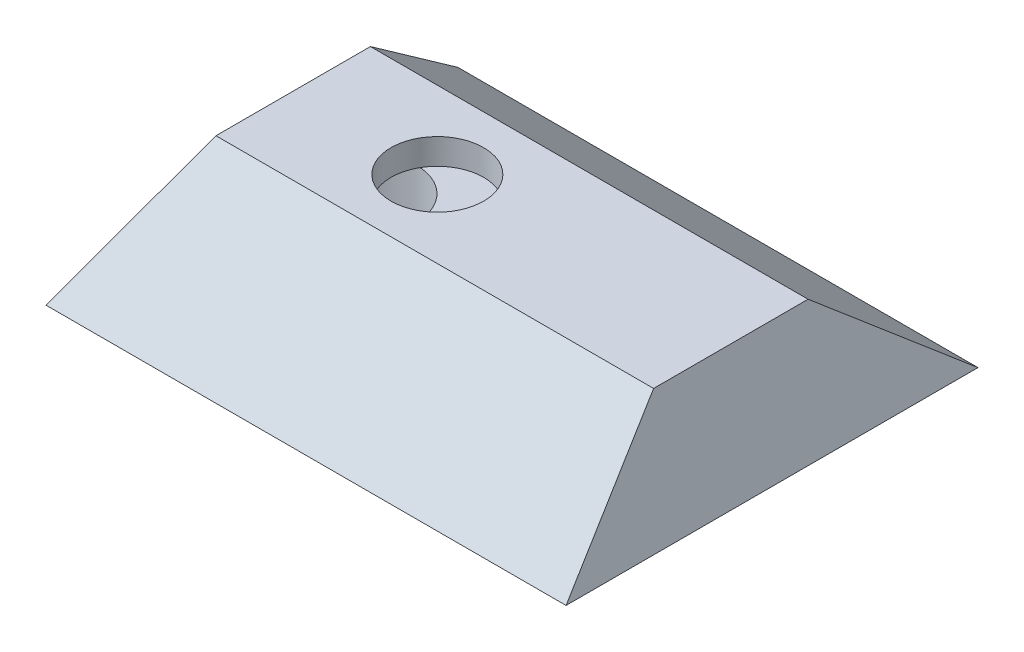
ISO-10303-21;
HEADER;
FILE_DESCRIPTION(('STEP AP214'),'2;1');
FILE_NAME('part.step','',(''),(''),'','','');
FILE_SCHEMA(('AUTOMOTIVE_DESIGN { 1 0 10303 214 1 1 1 1 }'));
ENDSEC;
DATA;
#1=APPLICATION_CONTEXT('core data for automotive mechanical design processes');
#2=APPLICATION_PROTOCOL_DEFINITION('international standard','automotive_design',2000,#1);
#3=PRODUCT_CONTEXT('',#1,'mechanical');
#4=PRODUCT('Part','Part','',(#3));
#5=PRODUCT_RELATED_PRODUCT_CATEGORY('part','',(#4));
#6=PRODUCT_DEFINITION_FORMATION('','',#4);
#7=PRODUCT_DEFINITION_CONTEXT('part definition',#1,'design');
#8=PRODUCT_DEFINITION('design','',#6,#7);
#9=PRODUCT_DEFINITION_SHAPE('','',#8);
#10=(LENGTH_UNIT() NAMED_UNIT(*) SI_UNIT(.MILLI.,.METRE.));
#11=(NAMED_UNIT(*) PLANE_ANGLE_UNIT() SI_UNIT($,.RADIAN.));
#12=(NAMED_UNIT(*) SI_UNIT($,.STERADIAN.) SOLID_ANGLE_UNIT());
#13=UNCERTAINTY_MEASURE_WITH_UNIT(LENGTH_MEASURE(1.E-05),#10,'distance_accuracy_value','');
#14=(GEOMETRIC_REPRESENTATION_CONTEXT(3) GLOBAL_UNCERTAINTY_ASSIGNED_CONTEXT((#13)) GLOBAL_UNIT_ASSIGNED_CONTEXT((#10,
#11,#12)) REPRESENTATION_CONTEXT('',''));
#15=CARTESIAN_POINT('',(0.,0.,0.));
#16=DIRECTION('',(0.,0.,1.));
#17=DIRECTION('',(1.,0.,0.));
#18=AXIS2_PLACEMENT_3D('',#15,#16,#17);
#19=CARTESIAN_POINT('',(-14.5,0.,0.));
#20=DIRECTION('',(0.,1.,0.));
#21=DIRECTION('',(0.,0.,1.));
#22=AXIS2_PLACEMENT_3D('',#19,#20,#21);
#23=CYLINDRICAL_SURFACE('',#22,3.5);
#24=CARTESIAN_POINT('',(-14.5,-6.,0.));
#25=DIRECTION('',(0.,-1.,0.));
#26=DIRECTION('',(0.,0.,-1.));
#27=AXIS2_PLACEMENT_3D('',#24,#25,#26);
#28=CIRCLE('',#27,3.5);
#29=CARTESIAN_POINT('',(-14.5,-6.,-3.5));
#30=VERTEX_POINT('',#29);
#31=EDGE_CURVE('E280',#30,#30,#28,.F.);
#32=ORIENTED_EDGE('',*,*,#31,.F.);
#33=EDGE_LOOP('',(#32));
#34=FACE_BOUND('',#33,.T.);
#35=CARTESIAN_POINT('',(-14.5,3.,0.));
#36=DIRECTION('',(0.,1.,0.));
#37=DIRECTION('',(0.,0.,1.));
#38=AXIS2_PLACEMENT_3D('',#35,#36,#37);
#39=CIRCLE('',#38,3.5);
#40=CARTESIAN_POINT('',(-14.5,3.,3.5));
#41=VERTEX_POINT('',#40);
#42=EDGE_CURVE('E267',#41,#41,#39,.F.);
#43=ORIENTED_EDGE('',*,*,#42,.F.);
#44=EDGE_LOOP('',(#43));
#45=FACE_BOUND('',#44,.T.);
#46=ADVANCED_FACE('F46',(#34,#45),#23,.F.);
#47=CARTESIAN_POINT('',(0.,7.,0.));
#48=DIRECTION('',(0.,-1.,0.));
#49=DIRECTION('',(0.,0.,-1.));
#50=AXIS2_PLACEMENT_3D('',#47,#48,#49);
#51=PLANE('',#50);
#52=CARTESIAN_POINT('',(-35.,7.,-7.));
#53=DIRECTION('',(0.,-1.,0.));
#54=DIRECTION('',(0.,0.,-1.));
#55=AXIS2_PLACEMENT_3D('',#52,#53,#54);
#56=CIRCLE('',#55,9.5);
#57=CARTESIAN_POINT('',(-40.,7.,1.07774721070176));
#58=VERTEX_POINT('',#57);
#59=CARTESIAN_POINT('',(-40.,7.,-15.0777472107018));
#60=VERTEX_POINT('',#59);
#61=EDGE_CURVE('E294',#58,#60,#56,.T.);
#62=ORIENTED_EDGE('',*,*,#61,.T.);
#63=DIRECTION('',(0.,0.,1.));
#64=VECTOR('',#63,1.);
#65=CARTESIAN_POINT('',(-40.,7.,0.));
#66=LINE('',#65,#64);
#67=EDGE_CURVE('E68',#60,#58,#66,.T.);
#68=ORIENTED_EDGE('',*,*,#67,.T.);
#69=EDGE_LOOP('',(#62,#68));
#70=FACE_BOUND('',#69,.T.);
#71=ADVANCED_FACE('F403',(#70),#51,.T.);
#72=CARTESIAN_POINT('',(-35.,7.,-7.));
#73=DIRECTION('',(0.,-1.,0.));
#74=DIRECTION('',(0.,0.,-1.));
#75=AXIS2_PLACEMENT_3D('',#72,#73,#74);
#76=CYLINDRICAL_SURFACE('',#75,9.5);
#77=CARTESIAN_POINT('',(-35.,-19.,-7.));
#78=DIRECTION('',(0.,-1.,0.));
#79=DIRECTION('',(0.,0.,-1.));
#80=AXIS2_PLACEMENT_3D('',#77,#78,#79);
#81=CIRCLE('',#80,9.5);
#82=CARTESIAN_POINT('',(-35.,-19.,-16.5));
#83=VERTEX_POINT('',#82);
#84=EDGE_CURVE('E273',#83,#83,#81,.T.);
#85=ORIENTED_EDGE('',*,*,#84,.T.);
#86=EDGE_LOOP('',(#85));
#87=FACE_BOUND('',#86,.T.);
#88=DIRECTION('',(0.,-1.,0.));
#89=VECTOR('',#88,1.);
#90=CARTESIAN_POINT('',(-40.,7.,1.07774721070176));
#91=LINE('',#90,#89);
#92=CARTESIAN_POINT('',(-40.,3.,1.07774721070176));
#93=VERTEX_POINT('',#92);
#94=EDGE_CURVE('E13',#93,#58,#91,.F.);
#95=ORIENTED_EDGE('',*,*,#94,.F.);
#96=CARTESIAN_POINT('',(-35.,3.,-7.));
#97=DIRECTION('',(0.,1.,0.));
#98=DIRECTION('',(0.,0.,1.));
#99=AXIS2_PLACEMENT_3D('',#96,#97,#98);
#100=CIRCLE('',#99,9.5);
#101=CARTESIAN_POINT('',(-40.,3.,-15.0777472107018));
#102=VERTEX_POINT('',#101);
#103=EDGE_CURVE('E54',#102,#93,#100,.F.);
#104=ORIENTED_EDGE('',*,*,#103,.F.);
#105=DIRECTION('',(0.,-1.,0.));
#106=VECTOR('',#105,1.);
#107=CARTESIAN_POINT('',(-40.,7.,-15.0777472107018));
#108=LINE('',#107,#106);
#109=EDGE_CURVE('E388',#60,#102,#108,.T.);
#110=ORIENTED_EDGE('',*,*,#109,.F.);
#111=ORIENTED_EDGE('',*,*,#61,.F.);
#112=EDGE_LOOP('',(#95,#104,#110,#111));
#113=FACE_BOUND('',#112,.T.);
#114=ADVANCED_FACE('F401',(#87,#113),#76,.F.);
#115=CARTESIAN_POINT('',(0.,-6.,0.));
#116=DIRECTION('',(0.,-1.,0.));
#117=DIRECTION('',(0.,0.,-1.));
#118=AXIS2_PLACEMENT_3D('',#115,#116,#117);
#119=PLANE('',#118);
#120=DIRECTION('',(-0.991377719329722,0.,0.131035177019758));
#121=VECTOR('',#120,1.);
#122=CARTESIAN_POINT('',(0.258679788565059,-6.,1.95710331116396));
#123=LINE('',#122,#121);
#124=CARTESIAN_POINT('',(-9.5,-6.,3.24695510896138));
#125=VERTEX_POINT('',#124);
#126=CARTESIAN_POINT('',(-33.2310251102333,-6.,6.38359921095124));
#127=VERTEX_POINT('',#126);
#128=EDGE_CURVE('E285',#125,#127,#123,.T.);
#129=ORIENTED_EDGE('',*,*,#128,.T.);
#130=CARTESIAN_POINT('',(-35.,-6.,-7.));
#131=DIRECTION('',(0.,-1.,0.));
#132=DIRECTION('',(0.,0.,-1.));
#133=AXIS2_PLACEMENT_3D('',#130,#131,#132);
#134=CIRCLE('',#133,13.5);
#135=CARTESIAN_POINT('',(-32.1926854124584,-6.,-20.2048848842607));
#136=VERTEX_POINT('',#135);
#137=EDGE_CURVE('E287',#127,#136,#134,.T.);
#138=ORIENTED_EDGE('',*,*,#137,.T.);
#139=DIRECTION('',(-0.978139621056347,0.,-0.207949228706783));
#140=VECTOR('',#139,1.);
#141=CARTESIAN_POINT('',(2.71763738571395,-6.,-12.783066420405));
#142=LINE('',#141,#140);
#143=CARTESIAN_POINT('',(-9.5,-6.,-15.3804954747915));
#144=VERTEX_POINT('',#143);
#145=EDGE_CURVE('E289',#144,#136,#142,.T.);
#146=ORIENTED_EDGE('',*,*,#145,.F.);
#147=DIRECTION('',(0.,0.,1.));
#148=VECTOR('',#147,1.);
#149=CARTESIAN_POINT('',(-9.5,-6.,0.));
#150=LINE('',#149,#148);
#151=EDGE_CURVE('E292',#144,#125,#150,.T.);
#152=ORIENTED_EDGE('',*,*,#151,.T.);
#153=EDGE_LOOP('',(#129,#138,#146,#152));
#154=FACE_BOUND('',#153,.T.);
#155=ORIENTED_EDGE('',*,*,#31,.T.);
#156=EDGE_LOOP('',(#155));
#157=FACE_BOUND('',#156,.T.);
#158=CARTESIAN_POINT('',(-35.,-6.,-7.));
#159=DIRECTION('',(0.,-1.,0.));
#160=DIRECTION('',(0.,0.,-1.));
#161=AXIS2_PLACEMENT_3D('',#158,#159,#160);
#162=CIRCLE('',#161,10.);
#163=CARTESIAN_POINT('',(-35.,-6.,-17.));
#164=VERTEX_POINT('',#163);
#165=EDGE_CURVE('E276',#164,#164,#162,.T.);
#166=ORIENTED_EDGE('',*,*,#165,.F.);
#167=EDGE_LOOP('',(#166));
#168=FACE_BOUND('',#167,.T.);
#169=ADVANCED_FACE('F410',(#154,#157,#168),#119,.T.);
#170=CARTESIAN_POINT('',(0.,20.,0.));
#171=DIRECTION('',(0.,1.,0.));
#172=DIRECTION('',(0.,0.,1.));
#173=AXIS2_PLACEMENT_3D('',#170,#171,#172);
#174=PLANE('',#173);
#175=CARTESIAN_POINT('',(-14.5,20.,0.));
#176=DIRECTION('',(0.,1.,0.));
#177=DIRECTION('',(0.,0.,1.));
#178=AXIS2_PLACEMENT_3D('',#175,#176,#177);
#179=CIRCLE('',#178,9.);
#180=CARTESIAN_POINT('',(-14.5,20.,9.));
#181=VERTEX_POINT('',#180);
#182=EDGE_CURVE('E344',#181,#181,#179,.T.);
#183=ORIENTED_EDGE('',*,*,#182,.F.);
#184=EDGE_LOOP('',(#183));
#185=FACE_BOUND('',#184,.T.);
#186=DIRECTION('',(0.,0.,-1.));
#187=VECTOR('',#186,1.);
#188=CARTESIAN_POINT('',(42.5,20.,-15.));
#189=LINE('',#188,#187);
#190=CARTESIAN_POINT('',(42.5,20.,15.));
#191=VERTEX_POINT('',#190);
#192=CARTESIAN_POINT('',(42.5,20.,-15.));
#193=VERTEX_POINT('',#192);
#194=EDGE_CURVE('E380',#191,#193,#189,.T.);
#195=ORIENTED_EDGE('',*,*,#194,.T.);
#196=DIRECTION('',(-1.,0.,0.));
#197=VECTOR('',#196,1.);
#198=CARTESIAN_POINT('',(-42.5,20.,-15.));
#199=LINE('',#198,#197);
#200=CARTESIAN_POINT('',(-42.5,20.,-15.));
#201=VERTEX_POINT('',#200);
#202=EDGE_CURVE('E382',#193,#201,#199,.T.);
#203=ORIENTED_EDGE('',*,*,#202,.T.);
#204=DIRECTION('',(0.,0.,1.));
#205=VECTOR('',#204,1.);
#206=CARTESIAN_POINT('',(-42.5,20.,-15.));
#207=LINE('',#206,#205);
#208=CARTESIAN_POINT('',(-42.5,20.,15.));
#209=VERTEX_POINT('',#208);
#210=EDGE_CURVE('E384',#201,#209,#207,.T.);
#211=ORIENTED_EDGE('',*,*,#210,.T.);
#212=DIRECTION('',(1.,0.,0.));
#213=VECTOR('',#212,1.);
#214=CARTESIAN_POINT('',(-42.5,20.,15.));
#215=LINE('',#214,#213);
#216=EDGE_CURVE('E386',#209,#191,#215,.T.);
#217=ORIENTED_EDGE('',*,*,#216,.T.);
#218=EDGE_LOOP('',(#195,#203,#211,#217));
#219=FACE_BOUND('',#218,.T.);
#220=ADVANCED_FACE('F474',(#185,#219),#174,.T.);
#221=CARTESIAN_POINT('',(0.,0.,0.));
#222=DIRECTION('',(0.,1.,0.));
#223=DIRECTION('',(0.,0.,1.));
#224=AXIS2_PLACEMENT_3D('',#221,#222,#223);
#225=PLANE('',#224);
#226=DIRECTION('',(0.,0.,1.));
#227=VECTOR('',#226,1.);
#228=CARTESIAN_POINT('',(42.9725378665182,0.,-25.6796791291549));
#229=LINE('',#228,#227);
#230=CARTESIAN_POINT('',(42.9725378665182,0.,-25.6796791291549));
#231=VERTEX_POINT('',#230);
#232=CARTESIAN_POINT('',(42.9725378665182,0.,20.8667200088257));
#233=VERTEX_POINT('',#232);
#234=EDGE_CURVE('E226',#231,#233,#229,.T.);
#235=ORIENTED_EDGE('',*,*,#234,.F.);
#236=DIRECTION('',(1.,0.,0.));
#237=VECTOR('',#236,1.);
#238=CARTESIAN_POINT('',(8.35418713721481,0.,-25.6796791291549));
#239=LINE('',#238,#237);
#240=CARTESIAN_POINT('',(8.35418713721481,0.,-25.6796791291549));
#241=VERTEX_POINT('',#240);
#242=EDGE_CURVE('E61',#241,#231,#239,.T.);
#243=ORIENTED_EDGE('',*,*,#242,.F.);
#244=DIRECTION('',(0.,0.,-1.));
#245=VECTOR('',#244,1.);
#246=CARTESIAN_POINT('',(8.35418713721481,0.,-25.6796791291549));
#247=LINE('',#246,#245);
#248=CARTESIAN_POINT('',(8.35418713721481,0.,20.8667200088257));
#249=VERTEX_POINT('',#248);
#250=EDGE_CURVE('E217',#249,#241,#247,.T.);
#251=ORIENTED_EDGE('',*,*,#250,.F.);
#252=DIRECTION('',(-1.,0.,0.));
#253=VECTOR('',#252,1.);
#254=CARTESIAN_POINT('',(8.35418713721481,0.,20.8667200088257));
#255=LINE('',#254,#253);
#256=EDGE_CURVE('E220',#233,#249,#255,.T.);
#257=ORIENTED_EDGE('',*,*,#256,.F.);
#258=EDGE_LOOP('',(#235,#243,#251,#257));
#259=FACE_BOUND('',#258,.T.);
#260=DIRECTION('',(-0.991377719329722,0.,0.131035177019758));
#261=VECTOR('',#260,1.);
#262=CARTESIAN_POINT('',(0.520750142604575,0.,3.9398587498234));
#263=LINE('',#262,#261);
#264=CARTESIAN_POINT('',(-7.5,0.,5.));
#265=VERTEX_POINT('',#264);
#266=CARTESIAN_POINT('',(-32.9689547561938,0.,8.36635464961069));
#267=VERTEX_POINT('',#266);
#268=EDGE_CURVE('E297',#265,#267,#263,.T.);
#269=ORIENTED_EDGE('',*,*,#268,.F.);
#270=DIRECTION('',(0.,0.,1.));
#271=VECTOR('',#270,1.);
#272=CARTESIAN_POINT('',(-7.5,0.,0.));
#273=LINE('',#272,#271);
#274=CARTESIAN_POINT('',(-7.5,0.,-17.));
#275=VERTEX_POINT('',#274);
#276=EDGE_CURVE('E302',#275,#265,#273,.T.);
#277=ORIENTED_EDGE('',*,*,#276,.F.);
#278=DIRECTION('',(-0.978139621056347,0.,-0.207949228706783));
#279=VECTOR('',#278,1.);
#280=CARTESIAN_POINT('',(3.13353584312752,0.,-14.7393456625177));
#281=LINE('',#280,#279);
#282=CARTESIAN_POINT('',(-31.7767869550449,0.,-22.1611641263734));
#283=VERTEX_POINT('',#282);
#284=EDGE_CURVE('E326',#275,#283,#281,.T.);
#285=ORIENTED_EDGE('',*,*,#284,.T.);
#286=CARTESIAN_POINT('',(-35.,0.,-7.));
#287=DIRECTION('',(0.,-1.,0.));
#288=DIRECTION('',(0.,0.,-1.));
#289=AXIS2_PLACEMENT_3D('',#286,#287,#288);
#290=CIRCLE('',#289,15.5);
#291=CARTESIAN_POINT('',(-50.5,0.,-7.));
#292=VERTEX_POINT('',#291);
#293=EDGE_CURVE('E327',#292,#283,#290,.T.);
#294=ORIENTED_EDGE('',*,*,#293,.F.);
#295=DIRECTION('',(0.,0.,1.));
#296=VECTOR('',#295,1.);
#297=CARTESIAN_POINT('',(-50.5,0.,-55.5112692638357));
#298=LINE('',#297,#296);
#299=CARTESIAN_POINT('',(-50.5,0.,-40.));
#300=VERTEX_POINT('',#299);
#301=EDGE_CURVE('E364',#300,#292,#298,.T.);
#302=ORIENTED_EDGE('',*,*,#301,.F.);
#303=DIRECTION('',(1.,0.,0.));
#304=VECTOR('',#303,1.);
#305=CARTESIAN_POINT('',(-74.5156211871643,0.,-40.));
#306=LINE('',#305,#304);
#307=CARTESIAN_POINT('',(50.5,0.,-40.));
#308=VERTEX_POINT('',#307);
#309=EDGE_CURVE('E378',#300,#308,#306,.T.);
#310=ORIENTED_EDGE('',*,*,#309,.T.);
#311=DIRECTION('',(0.,0.,1.));
#312=VECTOR('',#311,1.);
#313=CARTESIAN_POINT('',(50.5,0.,-55.5112692638357));
#314=LINE('',#313,#312);
#315=CARTESIAN_POINT('',(50.5,0.,40.));
#316=VERTEX_POINT('',#315);
#317=EDGE_CURVE('E370',#308,#316,#314,.T.);
#318=ORIENTED_EDGE('',*,*,#317,.T.);
#319=DIRECTION('',(1.,0.,0.));
#320=VECTOR('',#319,1.);
#321=CARTESIAN_POINT('',(-74.5156211871643,0.,40.));
#322=LINE('',#321,#320);
#323=CARTESIAN_POINT('',(-50.5,0.,40.));
#324=VERTEX_POINT('',#323);
#325=EDGE_CURVE('E374',#324,#316,#322,.T.);
#326=ORIENTED_EDGE('',*,*,#325,.F.);
#327=EDGE_CURVE('E363',#292,#324,#298,.T.);
#328=ORIENTED_EDGE('',*,*,#327,.F.);
#329=EDGE_CURVE('E323',#267,#292,#290,.T.);
#330=ORIENTED_EDGE('',*,*,#329,.F.);
#331=EDGE_LOOP('',(#269,#277,#285,#294,#302,#310,#318,#326,#328,#330));
#332=FACE_BOUND('',#331,.T.);
#333=ADVANCED_FACE('F48',(#259,#332),#225,.F.);
#334=CARTESIAN_POINT('',(-74.5156211871643,20.,-15.));
#335=DIRECTION('',(0.,0.78086880944303,-0.624695047554424));
#336=DIRECTION('',(0.,0.624695047554424,0.78086880944303));
#337=AXIS2_PLACEMENT_3D('',#334,#335,#336);
#338=PLANE('',#337);
#339=ORIENTED_EDGE('',*,*,#309,.F.);
#340=DIRECTION('',(-0.242424242424242,-0.606060606060606,-0.757575757575758));
#341=VECTOR('',#340,1.);
#342=CARTESIAN_POINT('',(-49.9400861825226,1.39978454369343,-38.2502693203832));
#343=LINE('',#342,#341);
#344=EDGE_CURVE('E360',#201,#300,#343,.T.);
#345=ORIENTED_EDGE('',*,*,#344,.F.);
#346=ORIENTED_EDGE('',*,*,#202,.F.);
#347=DIRECTION('',(-0.242424242424243,0.606060606060606,0.757575757575758));
#348=VECTOR('',#347,1.);
#349=CARTESIAN_POINT('',(49.9400861825226,1.39978454369345,-38.2502693203832));
#350=LINE('',#349,#348);
#351=EDGE_CURVE('E371',#308,#193,#350,.T.);
#352=ORIENTED_EDGE('',*,*,#351,.F.);
#353=EDGE_LOOP('',(#339,#345,#346,#352));
#354=FACE_BOUND('',#353,.T.);
#355=ADVANCED_FACE('F470',(#354),#338,.T.);
#356=CARTESIAN_POINT('',(-74.5156211871643,20.,15.));
#357=DIRECTION('',(0.,0.78086880944303,0.624695047554424));
#358=DIRECTION('',(0.,-0.624695047554424,0.78086880944303));
#359=AXIS2_PLACEMENT_3D('',#356,#357,#358);
#360=PLANE('',#359);
#361=ORIENTED_EDGE('',*,*,#216,.F.);
#362=DIRECTION('',(-0.242424242424242,-0.606060606060606,0.757575757575758));
#363=VECTOR('',#362,1.);
#364=CARTESIAN_POINT('',(-49.9400861825226,1.39978454369343,38.2502693203832));
#365=LINE('',#364,#363);
#366=EDGE_CURVE('E357',#209,#324,#365,.T.);
#367=ORIENTED_EDGE('',*,*,#366,.T.);
#368=ORIENTED_EDGE('',*,*,#325,.T.);
#369=DIRECTION('',(-0.242424242424243,0.606060606060606,-0.757575757575758));
#370=VECTOR('',#369,1.);
#371=CARTESIAN_POINT('',(49.9400861825226,1.39978454369344,38.2502693203832));
#372=LINE('',#371,#370);
#373=EDGE_CURVE('E367',#316,#191,#372,.T.);
#374=ORIENTED_EDGE('',*,*,#373,.T.);
#375=EDGE_LOOP('',(#361,#367,#368,#374));
#376=FACE_BOUND('',#375,.T.);
#377=ADVANCED_FACE('F466',(#376),#360,.T.);
#378=CARTESIAN_POINT('',(42.5,20.,-55.5112692638357));
#379=DIRECTION('',(0.928476690885259,0.371390676354104,0.));
#380=DIRECTION('',(-0.371390676354104,0.928476690885259,0.));
#381=AXIS2_PLACEMENT_3D('',#378,#379,#380);
#382=PLANE('',#381);
#383=ORIENTED_EDGE('',*,*,#317,.F.);
#384=ORIENTED_EDGE('',*,*,#351,.T.);
#385=ORIENTED_EDGE('',*,*,#194,.F.);
#386=ORIENTED_EDGE('',*,*,#373,.F.);
#387=EDGE_LOOP('',(#383,#384,#385,#386));
#388=FACE_BOUND('',#387,.T.);
#389=ADVANCED_FACE('F462',(#388),#382,.T.);
#390=CARTESIAN_POINT('',(-42.5,20.,-55.5112692638357));
#391=DIRECTION('',(-0.92847669088526,0.371390676354103,0.));
#392=DIRECTION('',(-0.371390676354103,-0.92847669088526,0.));
#393=AXIS2_PLACEMENT_3D('',#390,#391,#392);
#394=PLANE('',#393);
#395=ORIENTED_EDGE('',*,*,#210,.F.);
#396=ORIENTED_EDGE('',*,*,#344,.T.);
#397=ORIENTED_EDGE('',*,*,#301,.T.);
#398=ORIENTED_EDGE('',*,*,#327,.T.);
#399=ORIENTED_EDGE('',*,*,#366,.F.);
#400=EDGE_LOOP('',(#395,#396,#397,#398,#399));
#401=FACE_BOUND('',#400,.T.);
#402=ADVANCED_FACE('F457',(#401),#394,.T.);
#403=CARTESIAN_POINT('',(-14.5,15.,0.));
#404=DIRECTION('',(0.,1.,0.));
#405=DIRECTION('',(0.,0.,1.));
#406=AXIS2_PLACEMENT_3D('',#403,#404,#405);
#407=CYLINDRICAL_SURFACE('',#406,9.);
#408=CARTESIAN_POINT('',(-14.5,15.,0.));
#409=DIRECTION('',(0.,-1.,0.));
#410=DIRECTION('',(0.,0.,-1.));
#411=AXIS2_PLACEMENT_3D('',#408,#409,#410);
#412=CIRCLE('',#411,9.);
#413=CARTESIAN_POINT('',(-14.5,15.,-9.));
#414=VERTEX_POINT('',#413);
#415=EDGE_CURVE('E270',#414,#414,#412,.F.);
#416=ORIENTED_EDGE('',*,*,#415,.F.);
#417=EDGE_LOOP('',(#416));
#418=FACE_BOUND('',#417,.T.);
#419=ORIENTED_EDGE('',*,*,#182,.T.);
#420=EDGE_LOOP('',(#419));
#421=FACE_BOUND('',#420,.T.);
#422=ADVANCED_FACE('F440',(#418,#421),#407,.F.);
#423=CARTESIAN_POINT('',(0.520750142604575,-9.,3.9398587498234));
#424=DIRECTION('',(-0.131035177019758,0.,-0.991377719329722));
#425=DIRECTION('',(-0.991377719329722,0.,0.131035177019758));
#426=AXIS2_PLACEMENT_3D('',#423,#424,#425);
#427=PLANE('',#426);
#428=ORIENTED_EDGE('',*,*,#268,.T.);
#429=DIRECTION('',(0.,1.,0.));
#430=VECTOR('',#429,1.);
#431=CARTESIAN_POINT('',(-32.9689547561938,-9.,8.36635464961069));
#432=LINE('',#431,#430);
#433=CARTESIAN_POINT('',(-32.9689547561938,-9.,8.36635464961069));
#434=VERTEX_POINT('',#433);
#435=EDGE_CURVE('E341',#434,#267,#432,.T.);
#436=ORIENTED_EDGE('',*,*,#435,.F.);
#437=DIRECTION('',(-0.991377719329722,0.,0.131035177019758));
#438=VECTOR('',#437,1.);
#439=CARTESIAN_POINT('',(0.520750142604575,-9.,3.9398587498234));
#440=LINE('',#439,#438);
#441=CARTESIAN_POINT('',(-7.5,-9.,5.));
#442=VERTEX_POINT('',#441);
#443=EDGE_CURVE('E310',#442,#434,#440,.T.);
#444=ORIENTED_EDGE('',*,*,#443,.F.);
#445=DIRECTION('',(0.,1.,0.));
#446=VECTOR('',#445,1.);
#447=CARTESIAN_POINT('',(-7.5,-9.,5.));
#448=LINE('',#447,#446);
#449=EDGE_CURVE('E331',#442,#265,#448,.T.);
#450=ORIENTED_EDGE('',*,*,#449,.T.);
#451=EDGE_LOOP('',(#428,#436,#444,#450));
#452=FACE_BOUND('',#451,.T.);
#453=ADVANCED_FACE('F436',(#452),#427,.F.);
#454=CARTESIAN_POINT('',(-35.,-9.,-7.));
#455=DIRECTION('',(0.,1.,0.));
#456=DIRECTION('',(0.,0.,1.));
#457=AXIS2_PLACEMENT_3D('',#454,#455,#456);
#458=CYLINDRICAL_SURFACE('',#457,15.5);
#459=ORIENTED_EDGE('',*,*,#329,.T.);
#460=ORIENTED_EDGE('',*,*,#293,.T.);
#461=DIRECTION('',(0.,1.,0.));
#462=VECTOR('',#461,1.);
#463=CARTESIAN_POINT('',(-31.7767869550449,-9.,-22.1611641263734));
#464=LINE('',#463,#462);
#465=CARTESIAN_POINT('',(-31.7767869550449,-9.,-22.1611641263734));
#466=VERTEX_POINT('',#465);
#467=EDGE_CURVE('E338',#466,#283,#464,.T.);
#468=ORIENTED_EDGE('',*,*,#467,.F.);
#469=CARTESIAN_POINT('',(-35.,-9.,-7.));
#470=DIRECTION('',(0.,-1.,0.));
#471=DIRECTION('',(0.,0.,-1.));
#472=AXIS2_PLACEMENT_3D('',#469,#470,#471);
#473=CIRCLE('',#472,15.5);
#474=EDGE_CURVE('E313',#434,#466,#473,.T.);
#475=ORIENTED_EDGE('',*,*,#474,.F.);
#476=ORIENTED_EDGE('',*,*,#435,.T.);
#477=EDGE_LOOP('',(#459,#460,#468,#475,#476));
#478=FACE_BOUND('',#477,.T.);
#479=ADVANCED_FACE('F432',(#478),#458,.T.);
#480=CARTESIAN_POINT('',(3.13353584312752,-9.,-14.7393456625177));
#481=DIRECTION('',(0.207949228706783,0.,-0.978139621056347));
#482=DIRECTION('',(-0.978139621056347,0.,-0.207949228706783));
#483=AXIS2_PLACEMENT_3D('',#480,#481,#482);
#484=PLANE('',#483);
#485=ORIENTED_EDGE('',*,*,#284,.F.);
#486=DIRECTION('',(0.,1.,0.));
#487=VECTOR('',#486,1.);
#488=CARTESIAN_POINT('',(-7.5,-9.,-17.));
#489=LINE('',#488,#487);
#490=CARTESIAN_POINT('',(-7.5,-9.,-17.));
#491=VERTEX_POINT('',#490);
#492=EDGE_CURVE('E334',#491,#275,#489,.T.);
#493=ORIENTED_EDGE('',*,*,#492,.F.);
#494=DIRECTION('',(-0.978139621056347,0.,-0.207949228706783));
#495=VECTOR('',#494,1.);
#496=CARTESIAN_POINT('',(3.13353584312752,-9.,-14.7393456625177));
#497=LINE('',#496,#495);
#498=EDGE_CURVE('E315',#491,#466,#497,.T.);
#499=ORIENTED_EDGE('',*,*,#498,.T.);
#500=ORIENTED_EDGE('',*,*,#467,.T.);
#501=EDGE_LOOP('',(#485,#493,#499,#500));
#502=FACE_BOUND('',#501,.T.);
#503=ADVANCED_FACE('F428',(#502),#484,.T.);
#504=CARTESIAN_POINT('',(-35.,-9.,-7.));
#505=DIRECTION('',(0.,1.,0.));
#506=DIRECTION('',(0.,0.,1.));
#507=AXIS2_PLACEMENT_3D('',#504,#505,#506);
#508=CYLINDRICAL_SURFACE('',#507,13.5);
#509=ORIENTED_EDGE('',*,*,#137,.F.);
#510=DIRECTION('',(0.,1.,0.));
#511=VECTOR('',#510,1.);
#512=CARTESIAN_POINT('',(-33.2310251102333,-9.,6.38359921095124));
#513=LINE('',#512,#511);
#514=CARTESIAN_POINT('',(-33.2310251102333,-9.,6.38359921095124));
#515=VERTEX_POINT('',#514);
#516=EDGE_CURVE('E335',#515,#127,#513,.T.);
#517=ORIENTED_EDGE('',*,*,#516,.F.);
#518=CARTESIAN_POINT('',(-35.,-9.,-7.));
#519=DIRECTION('',(0.,-1.,0.));
#520=DIRECTION('',(0.,0.,-1.));
#521=AXIS2_PLACEMENT_3D('',#518,#519,#520);
#522=CIRCLE('',#521,13.5);
#523=CARTESIAN_POINT('',(-32.1926854124584,-9.,-20.2048848842607));
#524=VERTEX_POINT('',#523);
#525=EDGE_CURVE('E298',#515,#524,#522,.T.);
#526=ORIENTED_EDGE('',*,*,#525,.T.);
#527=DIRECTION('',(0.,1.,0.));
#528=VECTOR('',#527,1.);
#529=CARTESIAN_POINT('',(-32.1926854124584,-9.,-20.2048848842607));
#530=LINE('',#529,#528);
#531=EDGE_CURVE('E320',#524,#136,#530,.T.);
#532=ORIENTED_EDGE('',*,*,#531,.T.);
#533=EDGE_LOOP('',(#509,#517,#526,#532));
#534=FACE_BOUND('',#533,.T.);
#535=ADVANCED_FACE('F431',(#534),#508,.F.);
#536=CARTESIAN_POINT('',(0.258679788565059,-9.,1.95710331116396));
#537=DIRECTION('',(-0.131035177019758,0.,-0.991377719329722));
#538=DIRECTION('',(-0.991377719329722,0.,0.131035177019758));
#539=AXIS2_PLACEMENT_3D('',#536,#537,#538);
#540=PLANE('',#539);
#541=ORIENTED_EDGE('',*,*,#128,.F.);
#542=DIRECTION('',(0.,1.,0.));
#543=VECTOR('',#542,1.);
#544=CARTESIAN_POINT('',(-9.5,-9.,3.24695510896138));
#545=LINE('',#544,#543);
#546=CARTESIAN_POINT('',(-9.5,-9.,3.24695510896138));
#547=VERTEX_POINT('',#546);
#548=EDGE_CURVE('E350',#547,#125,#545,.T.);
#549=ORIENTED_EDGE('',*,*,#548,.F.);
#550=DIRECTION('',(-0.991377719329722,0.,0.131035177019758));
#551=VECTOR('',#550,1.);
#552=CARTESIAN_POINT('',(0.258679788565059,-9.,1.95710331116396));
#553=LINE('',#552,#551);
#554=EDGE_CURVE('E301',#547,#515,#553,.T.);
#555=ORIENTED_EDGE('',*,*,#554,.T.);
#556=ORIENTED_EDGE('',*,*,#516,.T.);
#557=EDGE_LOOP('',(#541,#549,#555,#556));
#558=FACE_BOUND('',#557,.T.);
#559=ADVANCED_FACE('F448',(#558),#540,.T.);
#560=CARTESIAN_POINT('',(-9.5,-9.,0.));
#561=DIRECTION('',(-1.,0.,0.));
#562=DIRECTION('',(0.,0.,1.));
#563=AXIS2_PLACEMENT_3D('',#560,#561,#562);
#564=PLANE('',#563);
#565=ORIENTED_EDGE('',*,*,#151,.F.);
#566=DIRECTION('',(0.,1.,0.));
#567=VECTOR('',#566,1.);
#568=CARTESIAN_POINT('',(-9.5,-9.,-15.3804954747915));
#569=LINE('',#568,#567);
#570=CARTESIAN_POINT('',(-9.5,-9.,-15.3804954747915));
#571=VERTEX_POINT('',#570);
#572=EDGE_CURVE('E347',#571,#144,#569,.T.);
#573=ORIENTED_EDGE('',*,*,#572,.F.);
#574=DIRECTION('',(0.,0.,1.));
#575=VECTOR('',#574,1.);
#576=CARTESIAN_POINT('',(-9.5,-9.,0.));
#577=LINE('',#576,#575);
#578=EDGE_CURVE('E305',#571,#547,#577,.T.);
#579=ORIENTED_EDGE('',*,*,#578,.T.);
#580=ORIENTED_EDGE('',*,*,#548,.T.);
#581=EDGE_LOOP('',(#565,#573,#579,#580));
#582=FACE_BOUND('',#581,.T.);
#583=ADVANCED_FACE('F444',(#582),#564,.T.);
#584=CARTESIAN_POINT('',(2.71763738571395,-9.,-12.783066420405));
#585=DIRECTION('',(0.207949228706783,0.,-0.978139621056347));
#586=DIRECTION('',(-0.978139621056347,0.,-0.207949228706783));
#587=AXIS2_PLACEMENT_3D('',#584,#585,#586);
#588=PLANE('',#587);
#589=ORIENTED_EDGE('',*,*,#572,.T.);
#590=ORIENTED_EDGE('',*,*,#145,.T.);
#591=ORIENTED_EDGE('',*,*,#531,.F.);
#592=DIRECTION('',(-0.978139621056347,0.,-0.207949228706783));
#593=VECTOR('',#592,1.);
#594=CARTESIAN_POINT('',(2.71763738571395,-9.,-12.783066420405));
#595=LINE('',#594,#593);
#596=EDGE_CURVE('E308',#571,#524,#595,.T.);
#597=ORIENTED_EDGE('',*,*,#596,.F.);
#598=EDGE_LOOP('',(#589,#590,#591,#597));
#599=FACE_BOUND('',#598,.T.);
#600=ADVANCED_FACE('F426',(#599),#588,.F.);
#601=CARTESIAN_POINT('',(-7.5,-9.,0.));
#602=DIRECTION('',(-1.,0.,0.));
#603=DIRECTION('',(0.,0.,1.));
#604=AXIS2_PLACEMENT_3D('',#601,#602,#603);
#605=PLANE('',#604);
#606=ORIENTED_EDGE('',*,*,#276,.T.);
#607=ORIENTED_EDGE('',*,*,#449,.F.);
#608=DIRECTION('',(0.,0.,1.));
#609=VECTOR('',#608,1.);
#610=CARTESIAN_POINT('',(-7.5,-9.,0.));
#611=LINE('',#610,#609);
#612=EDGE_CURVE('E318',#491,#442,#611,.T.);
#613=ORIENTED_EDGE('',*,*,#612,.F.);
#614=ORIENTED_EDGE('',*,*,#492,.T.);
#615=EDGE_LOOP('',(#606,#607,#613,#614));
#616=FACE_BOUND('',#615,.T.);
#617=ADVANCED_FACE('F422',(#616),#605,.F.);
#618=CARTESIAN_POINT('',(0.,-9.,0.));
#619=DIRECTION('',(0.,-1.,0.));
#620=DIRECTION('',(0.,0.,-1.));
#621=AXIS2_PLACEMENT_3D('',#618,#619,#620);
#622=PLANE('',#621);
#623=ORIENTED_EDGE('',*,*,#525,.F.);
#624=ORIENTED_EDGE('',*,*,#554,.F.);
#625=ORIENTED_EDGE('',*,*,#578,.F.);
#626=ORIENTED_EDGE('',*,*,#596,.T.);
#627=EDGE_LOOP('',(#623,#624,#625,#626));
#628=FACE_BOUND('',#627,.T.);
#629=ORIENTED_EDGE('',*,*,#443,.T.);
#630=ORIENTED_EDGE('',*,*,#474,.T.);
#631=ORIENTED_EDGE('',*,*,#498,.F.);
#632=ORIENTED_EDGE('',*,*,#612,.T.);
#633=EDGE_LOOP('',(#629,#630,#631,#632));
#634=FACE_BOUND('',#633,.T.);
#635=ADVANCED_FACE('F418',(#628,#634),#622,.T.);
#636=CARTESIAN_POINT('',(-35.,-19.,-7.));
#637=DIRECTION('',(0.,-1.,0.));
#638=DIRECTION('',(0.,0.,-1.));
#639=AXIS2_PLACEMENT_3D('',#636,#637,#638);
#640=PLANE('',#639);
#641=CARTESIAN_POINT('',(-35.,-19.,-7.));
#642=DIRECTION('',(0.,-1.,0.));
#643=DIRECTION('',(0.,0.,-1.));
#644=AXIS2_PLACEMENT_3D('',#641,#642,#643);
#645=CIRCLE('',#644,10.);
#646=CARTESIAN_POINT('',(-35.,-19.,-17.));
#647=VERTEX_POINT('',#646);
#648=EDGE_CURVE('E277',#647,#647,#645,.T.);
#649=ORIENTED_EDGE('',*,*,#648,.T.);
#650=EDGE_LOOP('',(#649));
#651=FACE_BOUND('',#650,.T.);
#652=ORIENTED_EDGE('',*,*,#84,.F.);
#653=EDGE_LOOP('',(#652));
#654=FACE_BOUND('',#653,.T.);
#655=ADVANCED_FACE('F421',(#651,#654),#640,.T.);
#656=CARTESIAN_POINT('',(-35.,-19.,-7.));
#657=DIRECTION('',(0.,1.,0.));
#658=DIRECTION('',(0.,0.,1.));
#659=AXIS2_PLACEMENT_3D('',#656,#657,#658);
#660=CYLINDRICAL_SURFACE('',#659,10.);
#661=ORIENTED_EDGE('',*,*,#648,.F.);
#662=EDGE_LOOP('',(#661));
#663=FACE_BOUND('',#662,.T.);
#664=ORIENTED_EDGE('',*,*,#165,.T.);
#665=EDGE_LOOP('',(#664));
#666=FACE_BOUND('',#665,.T.);
#667=ADVANCED_FACE('F517',(#663,#666),#660,.T.);
#668=CARTESIAN_POINT('',(5.,15.,18.8488284109627));
#669=DIRECTION('',(0.,-1.,0.));
#670=DIRECTION('',(0.,0.,-1.));
#671=AXIS2_PLACEMENT_3D('',#668,#669,#670);
#672=PLANE('',#671);
#673=DIRECTION('',(-1.,0.,0.));
#674=VECTOR('',#673,1.);
#675=CARTESIAN_POINT('',(5.,15.,-18.8488284109627));
#676=LINE('',#675,#674);
#677=CARTESIAN_POINT('',(5.,15.,-18.8488284109627));
#678=VERTEX_POINT('',#677);
#679=CARTESIAN_POINT('',(-40.,15.,-18.8488284109627));
#680=VERTEX_POINT('',#679);
#681=EDGE_CURVE('E259',#678,#680,#676,.T.);
#682=ORIENTED_EDGE('',*,*,#681,.F.);
#683=DIRECTION('',(0.,0.,1.));
#684=VECTOR('',#683,1.);
#685=CARTESIAN_POINT('',(5.,15.,18.8488284109627));
#686=LINE('',#685,#684);
#687=CARTESIAN_POINT('',(5.,15.,18.8488284109627));
#688=VERTEX_POINT('',#687);
#689=EDGE_CURVE('E255',#678,#688,#686,.T.);
#690=ORIENTED_EDGE('',*,*,#689,.T.);
#691=DIRECTION('',(-1.,0.,0.));
#692=VECTOR('',#691,1.);
#693=CARTESIAN_POINT('',(5.,15.,18.8488284109627));
#694=LINE('',#693,#692);
#695=CARTESIAN_POINT('',(-40.,15.,18.8488284109627));
#696=VERTEX_POINT('',#695);
#697=EDGE_CURVE('E257',#688,#696,#694,.T.);
#698=ORIENTED_EDGE('',*,*,#697,.T.);
#699=DIRECTION('',(0.,0.,1.));
#700=VECTOR('',#699,1.);
#701=CARTESIAN_POINT('',(-40.,15.,18.8488284109627));
#702=LINE('',#701,#700);
#703=EDGE_CURVE('E245',#680,#696,#702,.T.);
#704=ORIENTED_EDGE('',*,*,#703,.F.);
#705=EDGE_LOOP('',(#682,#690,#698,#704));
#706=FACE_BOUND('',#705,.T.);
#707=ORIENTED_EDGE('',*,*,#415,.T.);
#708=EDGE_LOOP('',(#707));
#709=FACE_BOUND('',#708,.T.);
#710=ADVANCED_FACE('F519',(#706,#709),#672,.T.);
#711=CARTESIAN_POINT('',(5.,3.,-33.8488284109627));
#712=DIRECTION('',(0.,1.,0.));
#713=DIRECTION('',(0.,0.,1.));
#714=AXIS2_PLACEMENT_3D('',#711,#712,#713);
#715=PLANE('',#714);
#716=ORIENTED_EDGE('',*,*,#103,.T.);
#717=DIRECTION('',(0.,0.,-1.));
#718=VECTOR('',#717,1.);
#719=CARTESIAN_POINT('',(-40.,3.,-33.8488284109627));
#720=LINE('',#719,#718);
#721=CARTESIAN_POINT('',(-40.,3.,33.8488284109627));
#722=VERTEX_POINT('',#721);
#723=EDGE_CURVE('E239',#722,#93,#720,.T.);
#724=ORIENTED_EDGE('',*,*,#723,.F.);
#725=DIRECTION('',(-1.,0.,0.));
#726=VECTOR('',#725,1.);
#727=CARTESIAN_POINT('',(5.,3.,33.8488284109627));
#728=LINE('',#727,#726);
#729=CARTESIAN_POINT('',(5.,3.,33.8488284109627));
#730=VERTEX_POINT('',#729);
#731=EDGE_CURVE('E264',#730,#722,#728,.T.);
#732=ORIENTED_EDGE('',*,*,#731,.F.);
#733=DIRECTION('',(0.,0.,-1.));
#734=VECTOR('',#733,1.);
#735=CARTESIAN_POINT('',(5.,3.,-33.8488284109627));
#736=LINE('',#735,#734);
#737=CARTESIAN_POINT('',(5.,3.,-33.8488284109627));
#738=VERTEX_POINT('',#737);
#739=EDGE_CURVE('E251',#730,#738,#736,.T.);
#740=ORIENTED_EDGE('',*,*,#739,.T.);
#741=DIRECTION('',(-1.,0.,0.));
#742=VECTOR('',#741,1.);
#743=CARTESIAN_POINT('',(5.,3.,-33.8488284109627));
#744=LINE('',#743,#742);
#745=CARTESIAN_POINT('',(-40.,3.,-33.8488284109627));
#746=VERTEX_POINT('',#745);
#747=EDGE_CURVE('E261',#738,#746,#744,.T.);
#748=ORIENTED_EDGE('',*,*,#747,.T.);
#749=EDGE_CURVE('E238',#102,#746,#720,.T.);
#750=ORIENTED_EDGE('',*,*,#749,.F.);
#751=EDGE_LOOP('',(#716,#724,#732,#740,#748,#750));
#752=FACE_BOUND('',#751,.T.);
#753=ORIENTED_EDGE('',*,*,#42,.T.);
#754=EDGE_LOOP('',(#753));
#755=FACE_BOUND('',#754,.T.);
#756=ADVANCED_FACE('F393',(#752,#755),#715,.T.);
#757=CARTESIAN_POINT('',(-40.,0.,0.));
#758=DIRECTION('',(1.,0.,0.));
#759=DIRECTION('',(0.,0.,-1.));
#760=AXIS2_PLACEMENT_3D('',#757,#758,#759);
#761=PLANE('',#760);
#762=ORIENTED_EDGE('',*,*,#94,.T.);
#763=ORIENTED_EDGE('',*,*,#67,.F.);
#764=ORIENTED_EDGE('',*,*,#109,.T.);
#765=ORIENTED_EDGE('',*,*,#749,.T.);
#766=DIRECTION('',(0.,0.624695047554424,0.78086880944303));
#767=VECTOR('',#766,1.);
#768=CARTESIAN_POINT('',(-40.,3.,-33.8488284109627));
#769=LINE('',#768,#767);
#770=EDGE_CURVE('E242',#746,#680,#769,.T.);
#771=ORIENTED_EDGE('',*,*,#770,.T.);
#772=ORIENTED_EDGE('',*,*,#703,.T.);
#773=DIRECTION('',(0.,-0.624695047554424,0.780868809443031));
#774=VECTOR('',#773,1.);
#775=CARTESIAN_POINT('',(-40.,3.,33.8488284109627));
#776=LINE('',#775,#774);
#777=EDGE_CURVE('E232',#696,#722,#776,.T.);
#778=ORIENTED_EDGE('',*,*,#777,.T.);
#779=ORIENTED_EDGE('',*,*,#723,.T.);
#780=EDGE_LOOP('',(#762,#763,#764,#765,#771,#772,#778,#779));
#781=FACE_BOUND('',#780,.T.);
#782=ADVANCED_FACE('F398',(#781),#761,.T.);
#783=CARTESIAN_POINT('',(5.,3.,33.8488284109627));
#784=DIRECTION('',(0.,-0.780868809443031,-0.624695047554424));
#785=DIRECTION('',(0.,0.624695047554424,-0.780868809443031));
#786=AXIS2_PLACEMENT_3D('',#783,#784,#785);
#787=PLANE('',#786);
#788=ORIENTED_EDGE('',*,*,#697,.F.);
#789=DIRECTION('',(0.,-0.624695047554424,0.780868809443031));
#790=VECTOR('',#789,1.);
#791=CARTESIAN_POINT('',(5.,3.,33.8488284109627));
#792=LINE('',#791,#790);
#793=EDGE_CURVE('E248',#688,#730,#792,.T.);
#794=ORIENTED_EDGE('',*,*,#793,.T.);
#795=ORIENTED_EDGE('',*,*,#731,.T.);
#796=ORIENTED_EDGE('',*,*,#777,.F.);
#797=EDGE_LOOP('',(#788,#794,#795,#796));
#798=FACE_BOUND('',#797,.T.);
#799=ADVANCED_FACE('F531',(#798),#787,.T.);
#800=CARTESIAN_POINT('',(5.,3.,-33.8488284109627));
#801=DIRECTION('',(0.,-0.78086880944303,0.624695047554424));
#802=DIRECTION('',(0.,-0.624695047554424,-0.780868809443031));
#803=AXIS2_PLACEMENT_3D('',#800,#801,#802);
#804=PLANE('',#803);
#805=ORIENTED_EDGE('',*,*,#747,.F.);
#806=DIRECTION('',(0.,0.624695047554424,0.78086880944303));
#807=VECTOR('',#806,1.);
#808=CARTESIAN_POINT('',(5.,3.,-33.8488284109627));
#809=LINE('',#808,#807);
#810=EDGE_CURVE('E253',#738,#678,#809,.T.);
#811=ORIENTED_EDGE('',*,*,#810,.T.);
#812=ORIENTED_EDGE('',*,*,#681,.T.);
#813=ORIENTED_EDGE('',*,*,#770,.F.);
#814=EDGE_LOOP('',(#805,#811,#812,#813));
#815=FACE_BOUND('',#814,.T.);
#816=ADVANCED_FACE('F534',(#815),#804,.T.);
#817=CARTESIAN_POINT('',(5.,0.,0.));
#818=DIRECTION('',(1.,0.,0.));
#819=DIRECTION('',(0.,0.,-1.));
#820=AXIS2_PLACEMENT_3D('',#817,#818,#819);
#821=PLANE('',#820);
#822=ORIENTED_EDGE('',*,*,#793,.F.);
#823=ORIENTED_EDGE('',*,*,#689,.F.);
#824=ORIENTED_EDGE('',*,*,#810,.F.);
#825=ORIENTED_EDGE('',*,*,#739,.F.);
#826=EDGE_LOOP('',(#822,#823,#824,#825));
#827=FACE_BOUND('',#826,.T.);
#828=ADVANCED_FACE('F539',(#827),#821,.F.);
#829=CARTESIAN_POINT('',(8.35418713721481,6.,-25.6796791291549));
#830=DIRECTION('',(0.,0.,-1.));
#831=DIRECTION('',(-1.,0.,0.));
#832=AXIS2_PLACEMENT_3D('',#829,#830,#831);
#833=PLANE('',#832);
#834=ORIENTED_EDGE('',*,*,#242,.T.);
#835=DIRECTION('',(0.,-1.,0.));
#836=VECTOR('',#835,1.);
#837=CARTESIAN_POINT('',(42.9725378665182,6.,-25.6796791291549));
#838=LINE('',#837,#836);
#839=CARTESIAN_POINT('',(42.9725378665182,6.,-25.6796791291549));
#840=VERTEX_POINT('',#839);
#841=EDGE_CURVE('E195',#840,#231,#838,.T.);
#842=ORIENTED_EDGE('',*,*,#841,.F.);
#843=DIRECTION('',(1.,0.,0.));
#844=VECTOR('',#843,1.);
#845=CARTESIAN_POINT('',(8.35418713721481,6.,-25.6796791291549));
#846=LINE('',#845,#844);
#847=CARTESIAN_POINT('',(8.35418713721481,6.,-25.6796791291549));
#848=VERTEX_POINT('',#847);
#849=EDGE_CURVE('E199',#848,#840,#846,.T.);
#850=ORIENTED_EDGE('',*,*,#849,.F.);
#851=DIRECTION('',(0.,-1.,0.));
#852=VECTOR('',#851,1.);
#853=CARTESIAN_POINT('',(8.35418713721481,6.,-25.6796791291549));
#854=LINE('',#853,#852);
#855=EDGE_CURVE('E230',#848,#241,#854,.T.);
#856=ORIENTED_EDGE('',*,*,#855,.T.);
#857=EDGE_LOOP('',(#834,#842,#850,#856));
#858=FACE_BOUND('',#857,.T.);
#859=ADVANCED_FACE('F197',(#858),#833,.F.);
#860=CARTESIAN_POINT('',(8.35418713721481,6.,-25.6796791291549));
#861=DIRECTION('',(-1.,0.,0.));
#862=DIRECTION('',(0.,0.,1.));
#863=AXIS2_PLACEMENT_3D('',#860,#861,#862);
#864=PLANE('',#863);
#865=ORIENTED_EDGE('',*,*,#250,.T.);
#866=ORIENTED_EDGE('',*,*,#855,.F.);
#867=DIRECTION('',(0.,0.,-1.));
#868=VECTOR('',#867,1.);
#869=CARTESIAN_POINT('',(8.35418713721481,6.,-25.6796791291549));
#870=LINE('',#869,#868);
#871=CARTESIAN_POINT('',(8.35418713721481,6.,20.8667200088257));
#872=VERTEX_POINT('',#871);
#873=EDGE_CURVE('E205',#872,#848,#870,.T.);
#874=ORIENTED_EDGE('',*,*,#873,.F.);
#875=DIRECTION('',(0.,-1.,0.));
#876=VECTOR('',#875,1.);
#877=CARTESIAN_POINT('',(8.35418713721481,6.,20.8667200088257));
#878=LINE('',#877,#876);
#879=EDGE_CURVE('E233',#872,#249,#878,.T.);
#880=ORIENTED_EDGE('',*,*,#879,.T.);
#881=EDGE_LOOP('',(#865,#866,#874,#880));
#882=FACE_BOUND('',#881,.T.);
#883=ADVANCED_FACE('F549',(#882),#864,.F.);
#884=CARTESIAN_POINT('',(8.35418713721481,6.,20.8667200088257));
#885=DIRECTION('',(0.,0.,1.));
#886=DIRECTION('',(1.,0.,0.));
#887=AXIS2_PLACEMENT_3D('',#884,#885,#886);
#888=PLANE('',#887);
#889=ORIENTED_EDGE('',*,*,#256,.T.);
#890=ORIENTED_EDGE('',*,*,#879,.F.);
#891=DIRECTION('',(-1.,0.,0.));
#892=VECTOR('',#891,1.);
#893=CARTESIAN_POINT('',(8.35418713721481,6.,20.8667200088257));
#894=LINE('',#893,#892);
#895=CARTESIAN_POINT('',(42.9725378665182,6.,20.8667200088257));
#896=VERTEX_POINT('',#895);
#897=EDGE_CURVE('E213',#896,#872,#894,.T.);
#898=ORIENTED_EDGE('',*,*,#897,.F.);
#899=DIRECTION('',(0.,-1.,0.));
#900=VECTOR('',#899,1.);
#901=CARTESIAN_POINT('',(42.9725378665182,6.,20.8667200088257));
#902=LINE('',#901,#900);
#903=EDGE_CURVE('E204',#896,#233,#902,.T.);
#904=ORIENTED_EDGE('',*,*,#903,.T.);
#905=EDGE_LOOP('',(#889,#890,#898,#904));
#906=FACE_BOUND('',#905,.T.);
#907=ADVANCED_FACE('F552',(#906),#888,.F.);
#908=CARTESIAN_POINT('',(42.9725378665182,6.,-25.6796791291549));
#909=DIRECTION('',(1.,0.,0.));
#910=DIRECTION('',(0.,0.,-1.));
#911=AXIS2_PLACEMENT_3D('',#908,#909,#910);
#912=PLANE('',#911);
#913=ORIENTED_EDGE('',*,*,#234,.T.);
#914=ORIENTED_EDGE('',*,*,#903,.F.);
#915=DIRECTION('',(0.,0.,1.));
#916=VECTOR('',#915,1.);
#917=CARTESIAN_POINT('',(42.9725378665182,6.,-25.6796791291549));
#918=LINE('',#917,#916);
#919=EDGE_CURVE('E208',#840,#896,#918,.T.);
#920=ORIENTED_EDGE('',*,*,#919,.F.);
#921=ORIENTED_EDGE('',*,*,#841,.T.);
#922=EDGE_LOOP('',(#913,#914,#920,#921));
#923=FACE_BOUND('',#922,.T.);
#924=ADVANCED_FACE('F209',(#923),#912,.F.);
#925=CARTESIAN_POINT('',(0.,6.,0.));
#926=DIRECTION('',(0.,-1.,0.));
#927=DIRECTION('',(0.,0.,-1.));
#928=AXIS2_PLACEMENT_3D('',#925,#926,#927);
#929=PLANE('',#928);
#930=ORIENTED_EDGE('',*,*,#849,.T.);
#931=ORIENTED_EDGE('',*,*,#919,.T.);
#932=ORIENTED_EDGE('',*,*,#897,.T.);
#933=ORIENTED_EDGE('',*,*,#873,.T.);
#934=EDGE_LOOP('',(#930,#931,#932,#933));
#935=FACE_BOUND('',#934,.T.);
#936=ADVANCED_FACE('F215',(#935),#929,.T.);
#937=CLOSED_SHELL('',(#46,#71,#114,#169,#220,#333,#355,#377,#389,#402,#422,#453,#479,#503,#535,
#559,#583,#600,#617,#635,#655,#667,#710,#756,#782,#799,#816,#828,#859,#883,#907,#924,#936));
#938=MANIFOLD_SOLID_BREP('B2',#937);
#939=ADVANCED_BREP_SHAPE_REPRESENTATION('',(#18,#938),#14);
#940=SHAPE_DEFINITION_REPRESENTATION(#9,#939);
ENDSEC;
END-ISO-10303-21;
